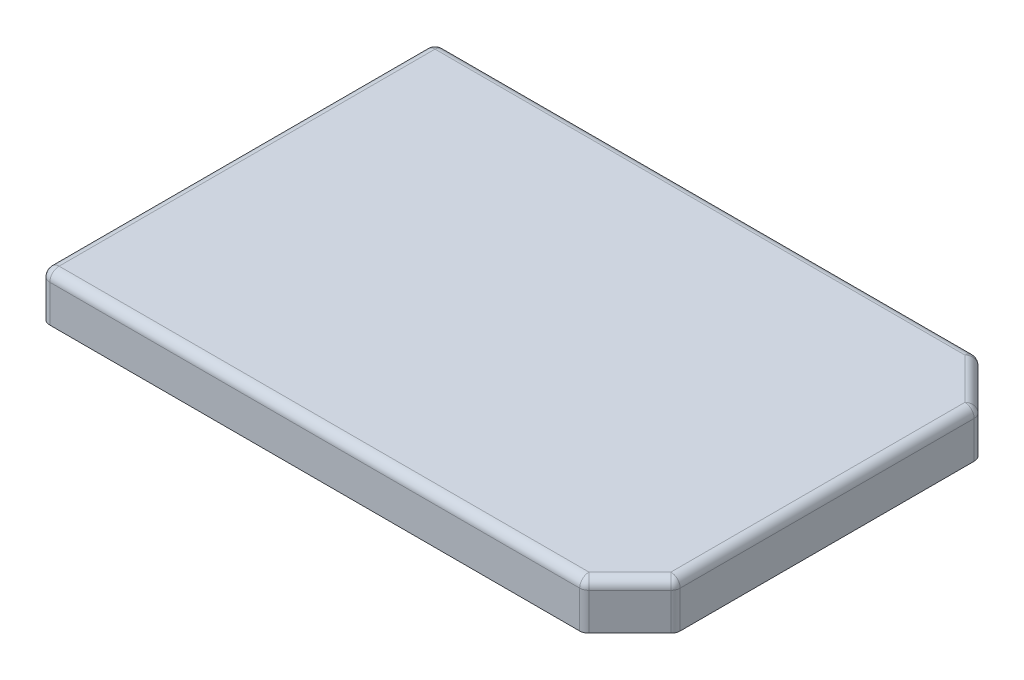
ISO-10303-21;
HEADER;
FILE_DESCRIPTION(('STEP AP214'),'2;1');
FILE_NAME('part.step','',(''),(''),'','','');
FILE_SCHEMA(('AUTOMOTIVE_DESIGN { 1 0 10303 214 1 1 1 1 }'));
ENDSEC;
DATA;
#1=APPLICATION_CONTEXT('core data for automotive mechanical design processes');
#2=APPLICATION_PROTOCOL_DEFINITION('international standard','automotive_design',2000,#1);
#3=PRODUCT_CONTEXT('',#1,'mechanical');
#4=PRODUCT('Part','Part','',(#3));
#5=PRODUCT_RELATED_PRODUCT_CATEGORY('part','',(#4));
#6=PRODUCT_DEFINITION_FORMATION('','',#4);
#7=PRODUCT_DEFINITION_CONTEXT('part definition',#1,'design');
#8=PRODUCT_DEFINITION('design','',#6,#7);
#9=PRODUCT_DEFINITION_SHAPE('','',#8);
#10=(LENGTH_UNIT() NAMED_UNIT(*) SI_UNIT(.MILLI.,.METRE.));
#11=(NAMED_UNIT(*) PLANE_ANGLE_UNIT() SI_UNIT($,.RADIAN.));
#12=(NAMED_UNIT(*) SI_UNIT($,.STERADIAN.) SOLID_ANGLE_UNIT());
#13=UNCERTAINTY_MEASURE_WITH_UNIT(LENGTH_MEASURE(1.E-05),#10,'distance_accuracy_value','');
#14=(GEOMETRIC_REPRESENTATION_CONTEXT(3) GLOBAL_UNCERTAINTY_ASSIGNED_CONTEXT((#13)) GLOBAL_UNIT_ASSIGNED_CONTEXT((#10,
#11,#12)) REPRESENTATION_CONTEXT('',''));
#15=CARTESIAN_POINT('',(0.,0.,0.));
#16=DIRECTION('',(0.,0.,1.));
#17=DIRECTION('',(1.,0.,0.));
#18=AXIS2_PLACEMENT_3D('',#15,#16,#17);
#19=CARTESIAN_POINT('',(0.,10.,0.));
#20=DIRECTION('',(1.,0.,0.));
#21=DIRECTION('',(0.,0.,-1.));
#22=AXIS2_PLACEMENT_3D('',#19,#20,#21);
#23=PLANE('',#22);
#24=DIRECTION('',(0.,-1.,0.));
#25=VECTOR('',#24,1.);
#26=CARTESIAN_POINT('',(0.,10.,83.));
#27=LINE('',#26,#25);
#28=CARTESIAN_POINT('',(0.,0.,83.));
#29=VERTEX_POINT('',#28);
#30=CARTESIAN_POINT('',(0.,8.,83.));
#31=VERTEX_POINT('',#30);
#32=EDGE_CURVE('E282',#29,#31,#27,.F.);
#33=ORIENTED_EDGE('',*,*,#32,.T.);
#34=DIRECTION('',(0.,0.,1.));
#35=VECTOR('',#34,1.);
#36=CARTESIAN_POINT('',(0.,8.,2.));
#37=LINE('',#36,#35);
#38=CARTESIAN_POINT('',(0.,8.,2.));
#39=VERTEX_POINT('',#38);
#40=EDGE_CURVE('E44',#31,#39,#37,.F.);
#41=ORIENTED_EDGE('',*,*,#40,.T.);
#42=DIRECTION('',(0.,-1.,0.));
#43=VECTOR('',#42,1.);
#44=CARTESIAN_POINT('',(0.,10.,2.));
#45=LINE('',#44,#43);
#46=CARTESIAN_POINT('',(0.,0.,2.));
#47=VERTEX_POINT('',#46);
#48=EDGE_CURVE('E280',#39,#47,#45,.T.);
#49=ORIENTED_EDGE('',*,*,#48,.T.);
#50=DIRECTION('',(0.,0.,1.));
#51=VECTOR('',#50,1.);
#52=CARTESIAN_POINT('',(0.,0.,0.));
#53=LINE('',#52,#51);
#54=EDGE_CURVE('E236',#47,#29,#53,.T.);
#55=ORIENTED_EDGE('',*,*,#54,.T.);
#56=EDGE_LOOP('',(#33,#41,#49,#55));
#57=FACE_BOUND('',#56,.T.);
#58=ADVANCED_FACE('F35',(#57),#23,.F.);
#59=CARTESIAN_POINT('',(0.,10.,85.));
#60=DIRECTION('',(0.,0.,-1.));
#61=DIRECTION('',(-1.,0.,0.));
#62=AXIS2_PLACEMENT_3D('',#59,#60,#61);
#63=PLANE('',#62);
#64=DIRECTION('',(0.,-1.,0.));
#65=VECTOR('',#64,1.);
#66=CARTESIAN_POINT('',(116.171572875254,10.,85.));
#67=LINE('',#66,#65);
#68=CARTESIAN_POINT('',(116.171572875254,0.,85.));
#69=VERTEX_POINT('',#68);
#70=CARTESIAN_POINT('',(116.171572875254,8.,85.));
#71=VERTEX_POINT('',#70);
#72=EDGE_CURVE('E277',#69,#71,#67,.F.);
#73=ORIENTED_EDGE('',*,*,#72,.T.);
#74=DIRECTION('',(1.,0.,0.));
#75=VECTOR('',#74,1.);
#76=CARTESIAN_POINT('',(2.00000000000001,8.,85.));
#77=LINE('',#76,#75);
#78=CARTESIAN_POINT('',(2.00000000000001,8.,85.));
#79=VERTEX_POINT('',#78);
#80=EDGE_CURVE('E326',#71,#79,#77,.F.);
#81=ORIENTED_EDGE('',*,*,#80,.T.);
#82=DIRECTION('',(0.,-1.,0.));
#83=VECTOR('',#82,1.);
#84=CARTESIAN_POINT('',(2.00000000000001,10.,85.));
#85=LINE('',#84,#83);
#86=CARTESIAN_POINT('',(2.00000000000001,0.,85.));
#87=VERTEX_POINT('',#86);
#88=EDGE_CURVE('E275',#79,#87,#85,.T.);
#89=ORIENTED_EDGE('',*,*,#88,.T.);
#90=DIRECTION('',(1.,0.,0.));
#91=VECTOR('',#90,1.);
#92=CARTESIAN_POINT('',(0.,0.,85.));
#93=LINE('',#92,#91);
#94=EDGE_CURVE('E239',#87,#69,#93,.T.);
#95=ORIENTED_EDGE('',*,*,#94,.T.);
#96=EDGE_LOOP('',(#73,#81,#89,#95));
#97=FACE_BOUND('',#96,.T.);
#98=ADVANCED_FACE('F462',(#97),#63,.F.);
#99=CARTESIAN_POINT('',(127.,10.,0.));
#100=DIRECTION('',(-1.,0.,0.));
#101=DIRECTION('',(0.,0.,1.));
#102=AXIS2_PLACEMENT_3D('',#99,#100,#101);
#103=PLANE('',#102);
#104=DIRECTION('',(0.,-1.,0.));
#105=VECTOR('',#104,1.);
#106=CARTESIAN_POINT('',(127.,10.,10.8284271247462));
#107=LINE('',#106,#105);
#108=CARTESIAN_POINT('',(127.,0.,10.8284271247462));
#109=VERTEX_POINT('',#108);
#110=CARTESIAN_POINT('',(127.,8.,10.8284271247462));
#111=VERTEX_POINT('',#110);
#112=EDGE_CURVE('E254',#109,#111,#107,.F.);
#113=ORIENTED_EDGE('',*,*,#112,.T.);
#114=DIRECTION('',(0.,0.,-1.));
#115=VECTOR('',#114,1.);
#116=CARTESIAN_POINT('',(127.,8.,74.1715728752538));
#117=LINE('',#116,#115);
#118=CARTESIAN_POINT('',(127.,8.,74.1715728752538));
#119=VERTEX_POINT('',#118);
#120=EDGE_CURVE('E11',#111,#119,#117,.F.);
#121=ORIENTED_EDGE('',*,*,#120,.T.);
#122=DIRECTION('',(0.,1.,0.));
#123=VECTOR('',#122,1.);
#124=CARTESIAN_POINT('',(127.,0.,74.1715728752538));
#125=LINE('',#124,#123);
#126=CARTESIAN_POINT('',(127.,0.,74.1715728752538));
#127=VERTEX_POINT('',#126);
#128=EDGE_CURVE('E256',#119,#127,#125,.F.);
#129=ORIENTED_EDGE('',*,*,#128,.T.);
#130=DIRECTION('',(0.,0.,-1.));
#131=VECTOR('',#130,1.);
#132=CARTESIAN_POINT('',(127.,0.,0.));
#133=LINE('',#132,#131);
#134=EDGE_CURVE('E242',#127,#109,#133,.T.);
#135=ORIENTED_EDGE('',*,*,#134,.T.);
#136=EDGE_LOOP('',(#113,#121,#129,#135));
#137=FACE_BOUND('',#136,.T.);
#138=ADVANCED_FACE('F422',(#137),#103,.F.);
#139=CARTESIAN_POINT('',(0.,10.,0.));
#140=DIRECTION('',(0.,0.,1.));
#141=DIRECTION('',(1.,0.,0.));
#142=AXIS2_PLACEMENT_3D('',#139,#140,#141);
#143=PLANE('',#142);
#144=DIRECTION('',(0.,-1.,0.));
#145=VECTOR('',#144,1.);
#146=CARTESIAN_POINT('',(2.,10.,0.));
#147=LINE('',#146,#145);
#148=CARTESIAN_POINT('',(2.,0.,0.));
#149=VERTEX_POINT('',#148);
#150=CARTESIAN_POINT('',(2.,8.,0.));
#151=VERTEX_POINT('',#150);
#152=EDGE_CURVE('E287',#149,#151,#147,.F.);
#153=ORIENTED_EDGE('',*,*,#152,.T.);
#154=DIRECTION('',(-1.,0.,0.));
#155=VECTOR('',#154,1.);
#156=CARTESIAN_POINT('',(116.171572875254,8.,0.));
#157=LINE('',#156,#155);
#158=CARTESIAN_POINT('',(116.171572875254,8.,0.));
#159=VERTEX_POINT('',#158);
#160=EDGE_CURVE('E319',#151,#159,#157,.F.);
#161=ORIENTED_EDGE('',*,*,#160,.T.);
#162=DIRECTION('',(0.,1.,0.));
#163=VECTOR('',#162,1.);
#164=CARTESIAN_POINT('',(116.171572875254,0.,0.));
#165=LINE('',#164,#163);
#166=CARTESIAN_POINT('',(116.171572875254,0.,0.));
#167=VERTEX_POINT('',#166);
#168=EDGE_CURVE('E285',#159,#167,#165,.F.);
#169=ORIENTED_EDGE('',*,*,#168,.T.);
#170=DIRECTION('',(-1.,0.,0.));
#171=VECTOR('',#170,1.);
#172=CARTESIAN_POINT('',(0.,0.,0.));
#173=LINE('',#172,#171);
#174=EDGE_CURVE('E245',#167,#149,#173,.T.);
#175=ORIENTED_EDGE('',*,*,#174,.T.);
#176=EDGE_LOOP('',(#153,#161,#169,#175));
#177=FACE_BOUND('',#176,.T.);
#178=ADVANCED_FACE('F376',(#177),#143,.F.);
#179=CARTESIAN_POINT('',(0.,10.,0.));
#180=DIRECTION('',(0.,1.,0.));
#181=DIRECTION('',(0.,0.,1.));
#182=AXIS2_PLACEMENT_3D('',#179,#180,#181);
#183=PLANE('',#182);
#184=DIRECTION('',(0.,0.,1.));
#185=VECTOR('',#184,1.);
#186=CARTESIAN_POINT('',(2.00000000000001,10.,83.));
#187=LINE('',#186,#185);
#188=CARTESIAN_POINT('',(2.,10.,2.));
#189=VERTEX_POINT('',#188);
#190=CARTESIAN_POINT('',(2.00000000000001,10.,83.));
#191=VERTEX_POINT('',#190);
#192=EDGE_CURVE('E307',#189,#191,#187,.T.);
#193=ORIENTED_EDGE('',*,*,#192,.T.);
#194=DIRECTION('',(1.,0.,0.));
#195=VECTOR('',#194,1.);
#196=CARTESIAN_POINT('',(116.171572875254,10.,83.));
#197=LINE('',#196,#195);
#198=CARTESIAN_POINT('',(116.171572875254,10.,83.));
#199=VERTEX_POINT('',#198);
#200=EDGE_CURVE('E309',#191,#199,#197,.T.);
#201=ORIENTED_EDGE('',*,*,#200,.T.);
#202=DIRECTION('',(-0.707106781186549,0.,0.707106781186546));
#203=VECTOR('',#202,1.);
#204=CARTESIAN_POINT('',(99.5857864376267,10.,99.5857864376271));
#205=LINE('',#204,#203);
#206=CARTESIAN_POINT('',(125.,10.,74.1715728752538));
#207=VERTEX_POINT('',#206);
#208=EDGE_CURVE('E304',#199,#207,#205,.F.);
#209=ORIENTED_EDGE('',*,*,#208,.T.);
#210=DIRECTION('',(0.,0.,-1.));
#211=VECTOR('',#210,1.);
#212=CARTESIAN_POINT('',(125.,10.,10.8284271247462));
#213=LINE('',#212,#211);
#214=CARTESIAN_POINT('',(125.,10.,10.8284271247462));
#215=VERTEX_POINT('',#214);
#216=EDGE_CURVE('E298',#207,#215,#213,.T.);
#217=ORIENTED_EDGE('',*,*,#216,.T.);
#218=DIRECTION('',(0.707106781186547,0.,0.707106781186549));
#219=VECTOR('',#218,1.);
#220=CARTESIAN_POINT('',(57.0857864376271,10.,-57.0857864376269));
#221=LINE('',#220,#219);
#222=CARTESIAN_POINT('',(116.171572875254,10.,2.));
#223=VERTEX_POINT('',#222);
#224=EDGE_CURVE('E300',#215,#223,#221,.F.);
#225=ORIENTED_EDGE('',*,*,#224,.T.);
#226=DIRECTION('',(-1.,0.,0.));
#227=VECTOR('',#226,1.);
#228=CARTESIAN_POINT('',(2.,10.,2.));
#229=LINE('',#228,#227);
#230=EDGE_CURVE('E302',#223,#189,#229,.T.);
#231=ORIENTED_EDGE('',*,*,#230,.T.);
#232=EDGE_LOOP('',(#193,#201,#209,#217,#225,#231));
#233=FACE_BOUND('',#232,.T.);
#234=ADVANCED_FACE('F403',(#233),#183,.T.);
#235=CARTESIAN_POINT('',(0.,0.,0.));
#236=DIRECTION('',(0.,1.,0.));
#237=DIRECTION('',(0.,0.,1.));
#238=AXIS2_PLACEMENT_3D('',#235,#236,#237);
#239=PLANE('',#238);
#240=DIRECTION('',(1.,0.,0.));
#241=VECTOR('',#240,1.);
#242=CARTESIAN_POINT('',(1.25000000000001,0.,1.25));
#243=LINE('',#242,#241);
#244=CARTESIAN_POINT('',(1.25000000000001,0.,1.25));
#245=VERTEX_POINT('',#244);
#246=CARTESIAN_POINT('',(115.75,0.,1.25));
#247=VERTEX_POINT('',#246);
#248=EDGE_CURVE('E216',#245,#247,#243,.T.);
#249=ORIENTED_EDGE('',*,*,#248,.F.);
#250=DIRECTION('',(0.,0.,-1.));
#251=VECTOR('',#250,1.);
#252=CARTESIAN_POINT('',(1.24999999999998,0.,83.75));
#253=LINE('',#252,#251);
#254=CARTESIAN_POINT('',(1.24999999999998,0.,83.75));
#255=VERTEX_POINT('',#254);
#256=EDGE_CURVE('E52',#255,#245,#253,.T.);
#257=ORIENTED_EDGE('',*,*,#256,.F.);
#258=DIRECTION('',(-1.,0.,0.));
#259=VECTOR('',#258,1.);
#260=CARTESIAN_POINT('',(1.24999999999998,0.,83.75));
#261=LINE('',#260,#259);
#262=CARTESIAN_POINT('',(115.75,0.,83.75));
#263=VERTEX_POINT('',#262);
#264=EDGE_CURVE('E202',#263,#255,#261,.T.);
#265=ORIENTED_EDGE('',*,*,#264,.F.);
#266=DIRECTION('',(-0.70710678118655,0.,0.707106781186545));
#267=VECTOR('',#266,1.);
#268=CARTESIAN_POINT('',(115.75,0.,83.75));
#269=LINE('',#268,#267);
#270=CARTESIAN_POINT('',(125.75,0.,73.7500000000001));
#271=VERTEX_POINT('',#270);
#272=EDGE_CURVE('E205',#271,#263,#269,.T.);
#273=ORIENTED_EDGE('',*,*,#272,.F.);
#274=DIRECTION('',(0.,0.,1.));
#275=VECTOR('',#274,1.);
#276=CARTESIAN_POINT('',(125.75,0.,73.7500000000001));
#277=LINE('',#276,#275);
#278=CARTESIAN_POINT('',(125.75,0.,11.25));
#279=VERTEX_POINT('',#278);
#280=EDGE_CURVE('E221',#279,#271,#277,.T.);
#281=ORIENTED_EDGE('',*,*,#280,.F.);
#282=DIRECTION('',(0.707106781186547,0.,0.707106781186548));
#283=VECTOR('',#282,1.);
#284=CARTESIAN_POINT('',(115.75,0.,1.25));
#285=LINE('',#284,#283);
#286=EDGE_CURVE('E218',#247,#279,#285,.T.);
#287=ORIENTED_EDGE('',*,*,#286,.F.);
#288=EDGE_LOOP('',(#249,#257,#265,#273,#281,#287));
#289=FACE_BOUND('',#288,.T.);
#290=ORIENTED_EDGE('',*,*,#134,.F.);
#291=CARTESIAN_POINT('',(125.,0.,74.1715728752538));
#292=DIRECTION('',(0.,1.,0.));
#293=DIRECTION('',(0.,0.,1.));
#294=AXIS2_PLACEMENT_3D('',#291,#292,#293);
#295=CIRCLE('',#294,2.);
#296=CARTESIAN_POINT('',(126.414213562373,0.,75.5857864376269));
#297=VERTEX_POINT('',#296);
#298=EDGE_CURVE('E268',#127,#297,#295,.F.);
#299=ORIENTED_EDGE('',*,*,#298,.T.);
#300=DIRECTION('',(0.707106781186549,0.,-0.707106781186546));
#301=VECTOR('',#300,1.);
#302=CARTESIAN_POINT('',(127.,0.,75.));
#303=LINE('',#302,#301);
#304=CARTESIAN_POINT('',(117.585786437627,0.,84.4142135623731));
#305=VERTEX_POINT('',#304);
#306=EDGE_CURVE('E251',#297,#305,#303,.F.);
#307=ORIENTED_EDGE('',*,*,#306,.T.);
#308=CARTESIAN_POINT('',(116.171572875254,0.,83.));
#309=DIRECTION('',(0.,1.,0.));
#310=DIRECTION('',(0.,0.,1.));
#311=AXIS2_PLACEMENT_3D('',#308,#309,#310);
#312=CIRCLE('',#311,2.);
#313=EDGE_CURVE('E266',#305,#69,#312,.F.);
#314=ORIENTED_EDGE('',*,*,#313,.T.);
#315=ORIENTED_EDGE('',*,*,#94,.F.);
#316=CARTESIAN_POINT('',(2.00000000000001,0.,83.));
#317=DIRECTION('',(0.,1.,0.));
#318=DIRECTION('',(0.,0.,1.));
#319=AXIS2_PLACEMENT_3D('',#316,#317,#318);
#320=CIRCLE('',#319,2.);
#321=EDGE_CURVE('E264',#87,#29,#320,.F.);
#322=ORIENTED_EDGE('',*,*,#321,.T.);
#323=ORIENTED_EDGE('',*,*,#54,.F.);
#324=CARTESIAN_POINT('',(2.,0.,2.));
#325=DIRECTION('',(0.,1.,0.));
#326=DIRECTION('',(0.,0.,1.));
#327=AXIS2_PLACEMENT_3D('',#324,#325,#326);
#328=CIRCLE('',#327,2.);
#329=EDGE_CURVE('E262',#47,#149,#328,.F.);
#330=ORIENTED_EDGE('',*,*,#329,.T.);
#331=ORIENTED_EDGE('',*,*,#174,.F.);
#332=CARTESIAN_POINT('',(116.171572875254,0.,2.));
#333=DIRECTION('',(0.,1.,0.));
#334=DIRECTION('',(0.,0.,1.));
#335=AXIS2_PLACEMENT_3D('',#332,#333,#334);
#336=CIRCLE('',#335,2.);
#337=CARTESIAN_POINT('',(117.585786437627,0.,0.5857864376269));
#338=VERTEX_POINT('',#337);
#339=EDGE_CURVE('E260',#167,#338,#336,.F.);
#340=ORIENTED_EDGE('',*,*,#339,.T.);
#341=DIRECTION('',(-0.707106781186547,0.,-0.707106781186549));
#342=VECTOR('',#341,1.);
#343=CARTESIAN_POINT('',(117.,0.,0.));
#344=LINE('',#343,#342);
#345=CARTESIAN_POINT('',(126.414213562373,0.,9.41421356237312));
#346=VERTEX_POINT('',#345);
#347=EDGE_CURVE('E248',#338,#346,#344,.F.);
#348=ORIENTED_EDGE('',*,*,#347,.T.);
#349=CARTESIAN_POINT('',(125.,0.,10.8284271247462));
#350=DIRECTION('',(0.,1.,0.));
#351=DIRECTION('',(0.,0.,1.));
#352=AXIS2_PLACEMENT_3D('',#349,#350,#351);
#353=CIRCLE('',#352,2.);
#354=EDGE_CURVE('E258',#346,#109,#353,.F.);
#355=ORIENTED_EDGE('',*,*,#354,.T.);
#356=EDGE_LOOP('',(#290,#299,#307,#314,#315,#322,#323,#330,#331,#340,#348,#355));
#357=FACE_BOUND('',#356,.T.);
#358=ADVANCED_FACE('F382',(#289,#357),#239,.F.);
#359=CARTESIAN_POINT('',(127.,10.,75.));
#360=DIRECTION('',(-0.707106781186546,0.,-0.707106781186549));
#361=DIRECTION('',(0.,-1.,0.));
#362=AXIS2_PLACEMENT_3D('',#359,#360,#361);
#363=PLANE('',#362);
#364=DIRECTION('',(0.,-1.,0.));
#365=VECTOR('',#364,1.);
#366=CARTESIAN_POINT('',(126.414213562373,10.,75.5857864376269));
#367=LINE('',#366,#365);
#368=CARTESIAN_POINT('',(126.414213562373,8.,75.5857864376269));
#369=VERTEX_POINT('',#368);
#370=EDGE_CURVE('E272',#297,#369,#367,.F.);
#371=ORIENTED_EDGE('',*,*,#370,.T.);
#372=DIRECTION('',(0.707106781186549,0.,-0.707106781186546));
#373=VECTOR('',#372,1.);
#374=CARTESIAN_POINT('',(127.,8.,75.));
#375=LINE('',#374,#373);
#376=CARTESIAN_POINT('',(117.585786437627,8.,84.4142135623731));
#377=VERTEX_POINT('',#376);
#378=EDGE_CURVE('E311',#369,#377,#375,.F.);
#379=ORIENTED_EDGE('',*,*,#378,.T.);
#380=DIRECTION('',(0.,1.,0.));
#381=VECTOR('',#380,1.);
#382=CARTESIAN_POINT('',(117.585786437627,0.,84.4142135623731));
#383=LINE('',#382,#381);
#384=EDGE_CURVE('E270',#377,#305,#383,.F.);
#385=ORIENTED_EDGE('',*,*,#384,.T.);
#386=ORIENTED_EDGE('',*,*,#306,.F.);
#387=EDGE_LOOP('',(#371,#379,#385,#386));
#388=FACE_BOUND('',#387,.T.);
#389=ADVANCED_FACE('F434',(#388),#363,.F.);
#390=CARTESIAN_POINT('',(117.,10.,0.));
#391=DIRECTION('',(-0.707106781186548,0.,0.707106781186546));
#392=DIRECTION('',(0.,-1.,0.));
#393=AXIS2_PLACEMENT_3D('',#390,#391,#392);
#394=PLANE('',#393);
#395=DIRECTION('',(0.,-1.,0.));
#396=VECTOR('',#395,1.);
#397=CARTESIAN_POINT('',(117.585786437627,10.,0.5857864376269));
#398=LINE('',#397,#396);
#399=CARTESIAN_POINT('',(117.585786437627,8.,0.5857864376269));
#400=VERTEX_POINT('',#399);
#401=EDGE_CURVE('E292',#338,#400,#398,.F.);
#402=ORIENTED_EDGE('',*,*,#401,.T.);
#403=DIRECTION('',(-0.707106781186547,0.,-0.707106781186549));
#404=VECTOR('',#403,1.);
#405=CARTESIAN_POINT('',(117.,8.,0.));
#406=LINE('',#405,#404);
#407=CARTESIAN_POINT('',(126.414213562373,8.,9.41421356237312));
#408=VERTEX_POINT('',#407);
#409=EDGE_CURVE('E323',#400,#408,#406,.F.);
#410=ORIENTED_EDGE('',*,*,#409,.T.);
#411=DIRECTION('',(0.,1.,0.));
#412=VECTOR('',#411,1.);
#413=CARTESIAN_POINT('',(126.414213562373,0.,9.41421356237312));
#414=LINE('',#413,#412);
#415=EDGE_CURVE('E290',#408,#346,#414,.F.);
#416=ORIENTED_EDGE('',*,*,#415,.T.);
#417=ORIENTED_EDGE('',*,*,#347,.F.);
#418=EDGE_LOOP('',(#402,#410,#416,#417));
#419=FACE_BOUND('',#418,.T.);
#420=ADVANCED_FACE('F417',(#419),#394,.F.);
#421=CARTESIAN_POINT('',(125.,10.,74.1715728752538));
#422=DIRECTION('',(0.,-1.,0.));
#423=DIRECTION('',(0.,0.,-1.));
#424=AXIS2_PLACEMENT_3D('',#421,#422,#423);
#425=CYLINDRICAL_SURFACE('',#424,2.);
#426=ORIENTED_EDGE('',*,*,#128,.F.);
#427=CARTESIAN_POINT('',(125.,8.,74.1715728752538));
#428=DIRECTION('',(0.,-1.,0.));
#429=DIRECTION('',(0.,0.,-1.));
#430=AXIS2_PLACEMENT_3D('',#427,#428,#429);
#431=CIRCLE('',#430,2.);
#432=EDGE_CURVE('E295',#119,#369,#431,.T.);
#433=ORIENTED_EDGE('',*,*,#432,.T.);
#434=ORIENTED_EDGE('',*,*,#370,.F.);
#435=ORIENTED_EDGE('',*,*,#298,.F.);
#436=EDGE_LOOP('',(#426,#433,#434,#435));
#437=FACE_BOUND('',#436,.T.);
#438=ADVANCED_FACE('F430',(#437),#425,.T.);
#439=CARTESIAN_POINT('',(116.171572875254,10.,83.));
#440=DIRECTION('',(0.,1.,0.));
#441=DIRECTION('',(0.,0.,1.));
#442=AXIS2_PLACEMENT_3D('',#439,#440,#441);
#443=CYLINDRICAL_SURFACE('',#442,2.);
#444=ORIENTED_EDGE('',*,*,#384,.F.);
#445=CARTESIAN_POINT('',(116.171572875254,8.,83.));
#446=DIRECTION('',(0.,1.,0.));
#447=DIRECTION('',(0.,0.,1.));
#448=AXIS2_PLACEMENT_3D('',#445,#446,#447);
#449=CIRCLE('',#448,2.);
#450=EDGE_CURVE('E313',#377,#71,#449,.F.);
#451=ORIENTED_EDGE('',*,*,#450,.T.);
#452=ORIENTED_EDGE('',*,*,#72,.F.);
#453=ORIENTED_EDGE('',*,*,#313,.F.);
#454=EDGE_LOOP('',(#444,#451,#452,#453));
#455=FACE_BOUND('',#454,.T.);
#456=ADVANCED_FACE('F439',(#455),#443,.T.);
#457=CARTESIAN_POINT('',(2.00000000000001,10.,83.));
#458=DIRECTION('',(0.,-1.,0.));
#459=DIRECTION('',(0.,0.,-1.));
#460=AXIS2_PLACEMENT_3D('',#457,#458,#459);
#461=CYLINDRICAL_SURFACE('',#460,2.);
#462=ORIENTED_EDGE('',*,*,#88,.F.);
#463=CARTESIAN_POINT('',(2.00000000000001,8.,83.));
#464=DIRECTION('',(0.,-1.,0.));
#465=DIRECTION('',(0.,0.,-1.));
#466=AXIS2_PLACEMENT_3D('',#463,#464,#465);
#467=CIRCLE('',#466,2.);
#468=EDGE_CURVE('E315',#79,#31,#467,.T.);
#469=ORIENTED_EDGE('',*,*,#468,.T.);
#470=ORIENTED_EDGE('',*,*,#32,.F.);
#471=ORIENTED_EDGE('',*,*,#321,.F.);
#472=EDGE_LOOP('',(#462,#469,#470,#471));
#473=FACE_BOUND('',#472,.T.);
#474=ADVANCED_FACE('F391',(#473),#461,.T.);
#475=CARTESIAN_POINT('',(2.,10.,2.));
#476=DIRECTION('',(0.,-1.,0.));
#477=DIRECTION('',(0.,0.,-1.));
#478=AXIS2_PLACEMENT_3D('',#475,#476,#477);
#479=CYLINDRICAL_SURFACE('',#478,2.);
#480=ORIENTED_EDGE('',*,*,#48,.F.);
#481=CARTESIAN_POINT('',(2.,8.,2.));
#482=DIRECTION('',(0.,-1.,0.));
#483=DIRECTION('',(0.,0.,-1.));
#484=AXIS2_PLACEMENT_3D('',#481,#482,#483);
#485=CIRCLE('',#484,2.);
#486=EDGE_CURVE('E317',#39,#151,#485,.T.);
#487=ORIENTED_EDGE('',*,*,#486,.T.);
#488=ORIENTED_EDGE('',*,*,#152,.F.);
#489=ORIENTED_EDGE('',*,*,#329,.F.);
#490=EDGE_LOOP('',(#480,#487,#488,#489));
#491=FACE_BOUND('',#490,.T.);
#492=ADVANCED_FACE('F373',(#491),#479,.T.);
#493=CARTESIAN_POINT('',(116.171572875254,10.,2.));
#494=DIRECTION('',(0.,-1.,0.));
#495=DIRECTION('',(0.,0.,-1.));
#496=AXIS2_PLACEMENT_3D('',#493,#494,#495);
#497=CYLINDRICAL_SURFACE('',#496,2.);
#498=ORIENTED_EDGE('',*,*,#168,.F.);
#499=CARTESIAN_POINT('',(116.171572875254,8.,2.));
#500=DIRECTION('',(0.,-1.,0.));
#501=DIRECTION('',(0.,0.,-1.));
#502=AXIS2_PLACEMENT_3D('',#499,#500,#501);
#503=CIRCLE('',#502,2.);
#504=EDGE_CURVE('E321',#159,#400,#503,.T.);
#505=ORIENTED_EDGE('',*,*,#504,.T.);
#506=ORIENTED_EDGE('',*,*,#401,.F.);
#507=ORIENTED_EDGE('',*,*,#339,.F.);
#508=EDGE_LOOP('',(#498,#505,#506,#507));
#509=FACE_BOUND('',#508,.T.);
#510=ADVANCED_FACE('F483',(#509),#497,.T.);
#511=CARTESIAN_POINT('',(125.,10.,10.8284271247462));
#512=DIRECTION('',(0.,1.,0.));
#513=DIRECTION('',(0.,0.,1.));
#514=AXIS2_PLACEMENT_3D('',#511,#512,#513);
#515=CYLINDRICAL_SURFACE('',#514,2.);
#516=ORIENTED_EDGE('',*,*,#415,.F.);
#517=CARTESIAN_POINT('',(125.,8.,10.8284271247462));
#518=DIRECTION('',(0.,1.,0.));
#519=DIRECTION('',(0.,0.,1.));
#520=AXIS2_PLACEMENT_3D('',#517,#518,#519);
#521=CIRCLE('',#520,2.);
#522=EDGE_CURVE('E60',#408,#111,#521,.F.);
#523=ORIENTED_EDGE('',*,*,#522,.T.);
#524=ORIENTED_EDGE('',*,*,#112,.F.);
#525=ORIENTED_EDGE('',*,*,#354,.F.);
#526=EDGE_LOOP('',(#516,#523,#524,#525));
#527=FACE_BOUND('',#526,.T.);
#528=ADVANCED_FACE('F420',(#527),#515,.T.);
#529=CARTESIAN_POINT('',(2.,8.,2.));
#530=DIRECTION('',(0.,1.,0.));
#531=DIRECTION('',(0.,0.,1.));
#532=AXIS2_PLACEMENT_3D('',#529,#530,#531);
#533=SPHERICAL_SURFACE('',#532,2.);
#534=CARTESIAN_POINT('',(2.,8.,2.));
#535=DIRECTION('',(1.,0.,0.));
#536=DIRECTION('',(0.,0.,-1.));
#537=AXIS2_PLACEMENT_3D('',#534,#535,#536);
#538=CIRCLE('',#537,2.);
#539=EDGE_CURVE('E355',#151,#189,#538,.T.);
#540=ORIENTED_EDGE('',*,*,#539,.F.);
#541=ORIENTED_EDGE('',*,*,#486,.F.);
#542=CARTESIAN_POINT('',(2.,8.,2.));
#543=DIRECTION('',(0.,0.,1.));
#544=DIRECTION('',(1.,0.,0.));
#545=AXIS2_PLACEMENT_3D('',#542,#543,#544);
#546=CIRCLE('',#545,2.);
#547=EDGE_CURVE('E39',#189,#39,#546,.T.);
#548=ORIENTED_EDGE('',*,*,#547,.F.);
#549=EDGE_LOOP('',(#540,#541,#548));
#550=FACE_BOUND('',#549,.T.);
#551=ADVANCED_FACE('F37',(#550),#533,.T.);
#552=CARTESIAN_POINT('',(2.,8.,0.));
#553=DIRECTION('',(0.,0.,-1.));
#554=DIRECTION('',(-1.,0.,0.));
#555=AXIS2_PLACEMENT_3D('',#552,#553,#554);
#556=CYLINDRICAL_SURFACE('',#555,2.);
#557=ORIENTED_EDGE('',*,*,#547,.T.);
#558=ORIENTED_EDGE('',*,*,#40,.F.);
#559=CARTESIAN_POINT('',(2.00000000000001,8.,83.));
#560=DIRECTION('',(0.,0.,1.));
#561=DIRECTION('',(1.,0.,0.));
#562=AXIS2_PLACEMENT_3D('',#559,#560,#561);
#563=CIRCLE('',#562,2.);
#564=EDGE_CURVE('E353',#191,#31,#563,.T.);
#565=ORIENTED_EDGE('',*,*,#564,.F.);
#566=ORIENTED_EDGE('',*,*,#192,.F.);
#567=EDGE_LOOP('',(#557,#558,#565,#566));
#568=FACE_BOUND('',#567,.T.);
#569=ADVANCED_FACE('F366',(#568),#556,.T.);
#570=CARTESIAN_POINT('',(0.,8.,2.));
#571=DIRECTION('',(1.,0.,0.));
#572=DIRECTION('',(0.,0.,-1.));
#573=AXIS2_PLACEMENT_3D('',#570,#571,#572);
#574=CYLINDRICAL_SURFACE('',#573,2.);
#575=ORIENTED_EDGE('',*,*,#539,.T.);
#576=ORIENTED_EDGE('',*,*,#230,.F.);
#577=CARTESIAN_POINT('',(116.171572875254,8.,2.));
#578=DIRECTION('',(1.,0.,0.));
#579=DIRECTION('',(0.,0.,-1.));
#580=AXIS2_PLACEMENT_3D('',#577,#578,#579);
#581=CIRCLE('',#580,2.);
#582=EDGE_CURVE('E350',#159,#223,#581,.T.);
#583=ORIENTED_EDGE('',*,*,#582,.F.);
#584=ORIENTED_EDGE('',*,*,#160,.F.);
#585=EDGE_LOOP('',(#575,#576,#583,#584));
#586=FACE_BOUND('',#585,.T.);
#587=ADVANCED_FACE('F407',(#586),#574,.T.);
#588=CARTESIAN_POINT('',(2.00000000000001,8.,83.));
#589=DIRECTION('',(0.,1.,0.));
#590=DIRECTION('',(0.,0.,1.));
#591=AXIS2_PLACEMENT_3D('',#588,#589,#590);
#592=SPHERICAL_SURFACE('',#591,2.);
#593=ORIENTED_EDGE('',*,*,#564,.T.);
#594=ORIENTED_EDGE('',*,*,#468,.F.);
#595=CARTESIAN_POINT('',(2.00000000000001,8.,83.));
#596=DIRECTION('',(1.,0.,0.));
#597=DIRECTION('',(0.,0.,-1.));
#598=AXIS2_PLACEMENT_3D('',#595,#596,#597);
#599=CIRCLE('',#598,2.);
#600=EDGE_CURVE('E347',#191,#79,#599,.T.);
#601=ORIENTED_EDGE('',*,*,#600,.F.);
#602=EDGE_LOOP('',(#593,#594,#601));
#603=FACE_BOUND('',#602,.T.);
#604=ADVANCED_FACE('F395',(#603),#592,.T.);
#605=CARTESIAN_POINT('',(116.171572875254,8.,2.));
#606=DIRECTION('',(0.,1.,0.));
#607=DIRECTION('',(0.,0.,1.));
#608=AXIS2_PLACEMENT_3D('',#605,#606,#607);
#609=SPHERICAL_SURFACE('',#608,2.);
#610=ORIENTED_EDGE('',*,*,#504,.F.);
#611=ORIENTED_EDGE('',*,*,#582,.T.);
#612=CARTESIAN_POINT('',(116.171572875254,8.,2.));
#613=DIRECTION('',(0.707106781186549,0.,0.707106781186546));
#614=DIRECTION('',(0.707106781186546,0.,-0.707106781186549));
#615=AXIS2_PLACEMENT_3D('',#612,#613,#614);
#616=CIRCLE('',#615,2.);
#617=EDGE_CURVE('E344',#400,#223,#616,.T.);
#618=ORIENTED_EDGE('',*,*,#617,.F.);
#619=EDGE_LOOP('',(#610,#611,#618));
#620=FACE_BOUND('',#619,.T.);
#621=ADVANCED_FACE('F411',(#620),#609,.T.);
#622=CARTESIAN_POINT('',(0.,8.,83.));
#623=DIRECTION('',(-1.,0.,0.));
#624=DIRECTION('',(0.,0.,1.));
#625=AXIS2_PLACEMENT_3D('',#622,#623,#624);
#626=CYLINDRICAL_SURFACE('',#625,2.);
#627=ORIENTED_EDGE('',*,*,#600,.T.);
#628=ORIENTED_EDGE('',*,*,#80,.F.);
#629=CARTESIAN_POINT('',(116.171572875254,8.,83.));
#630=DIRECTION('',(1.,0.,0.));
#631=DIRECTION('',(0.,0.,-1.));
#632=AXIS2_PLACEMENT_3D('',#629,#630,#631);
#633=CIRCLE('',#632,2.);
#634=EDGE_CURVE('E341',#199,#71,#633,.T.);
#635=ORIENTED_EDGE('',*,*,#634,.F.);
#636=ORIENTED_EDGE('',*,*,#200,.F.);
#637=EDGE_LOOP('',(#627,#628,#635,#636));
#638=FACE_BOUND('',#637,.T.);
#639=ADVANCED_FACE('F399',(#638),#626,.T.);
#640=CARTESIAN_POINT('',(57.0857864376271,8.,-57.0857864376269));
#641=DIRECTION('',(0.707106781186547,0.,0.707106781186549));
#642=DIRECTION('',(0.707106781186549,0.,-0.707106781186547));
#643=AXIS2_PLACEMENT_3D('',#640,#641,#642);
#644=CYLINDRICAL_SURFACE('',#643,2.);
#645=ORIENTED_EDGE('',*,*,#617,.T.);
#646=ORIENTED_EDGE('',*,*,#224,.F.);
#647=CARTESIAN_POINT('',(125.,8.,10.8284271247462));
#648=DIRECTION('',(0.707106781186545,0.,0.70710678118655));
#649=DIRECTION('',(0.70710678118655,0.,-0.707106781186545));
#650=AXIS2_PLACEMENT_3D('',#647,#648,#649);
#651=CIRCLE('',#650,2.);
#652=EDGE_CURVE('E338',#408,#215,#651,.T.);
#653=ORIENTED_EDGE('',*,*,#652,.F.);
#654=ORIENTED_EDGE('',*,*,#409,.F.);
#655=EDGE_LOOP('',(#645,#646,#653,#654));
#656=FACE_BOUND('',#655,.T.);
#657=ADVANCED_FACE('F414',(#656),#644,.T.);
#658=CARTESIAN_POINT('',(116.171572875254,8.,83.));
#659=DIRECTION('',(0.,1.,0.));
#660=DIRECTION('',(0.,0.,1.));
#661=AXIS2_PLACEMENT_3D('',#658,#659,#660);
#662=SPHERICAL_SURFACE('',#661,2.);
#663=ORIENTED_EDGE('',*,*,#634,.T.);
#664=ORIENTED_EDGE('',*,*,#450,.F.);
#665=CARTESIAN_POINT('',(116.171572875254,8.,83.));
#666=DIRECTION('',(0.707106781186551,0.,-0.707106781186544));
#667=DIRECTION('',(-0.707106781186544,0.,-0.707106781186551));
#668=AXIS2_PLACEMENT_3D('',#665,#666,#667);
#669=CIRCLE('',#668,2.);
#670=EDGE_CURVE('E335',#199,#377,#669,.T.);
#671=ORIENTED_EDGE('',*,*,#670,.F.);
#672=EDGE_LOOP('',(#663,#664,#671));
#673=FACE_BOUND('',#672,.T.);
#674=ADVANCED_FACE('F442',(#673),#662,.T.);
#675=CARTESIAN_POINT('',(125.,8.,10.8284271247462));
#676=DIRECTION('',(0.,1.,0.));
#677=DIRECTION('',(0.,0.,1.));
#678=AXIS2_PLACEMENT_3D('',#675,#676,#677);
#679=SPHERICAL_SURFACE('',#678,2.);
#680=ORIENTED_EDGE('',*,*,#522,.F.);
#681=ORIENTED_EDGE('',*,*,#652,.T.);
#682=CARTESIAN_POINT('',(125.,8.,10.8284271247462));
#683=DIRECTION('',(0.,0.,1.));
#684=DIRECTION('',(1.,0.,0.));
#685=AXIS2_PLACEMENT_3D('',#682,#683,#684);
#686=CIRCLE('',#685,2.);
#687=EDGE_CURVE('E332',#111,#215,#686,.T.);
#688=ORIENTED_EDGE('',*,*,#687,.F.);
#689=EDGE_LOOP('',(#680,#681,#688));
#690=FACE_BOUND('',#689,.T.);
#691=ADVANCED_FACE('F452',(#690),#679,.T.);
#692=CARTESIAN_POINT('',(99.5857864376267,8.,99.5857864376271));
#693=DIRECTION('',(-0.707106781186549,0.,0.707106781186546));
#694=DIRECTION('',(0.707106781186546,0.,0.707106781186549));
#695=AXIS2_PLACEMENT_3D('',#692,#693,#694);
#696=CYLINDRICAL_SURFACE('',#695,2.);
#697=ORIENTED_EDGE('',*,*,#670,.T.);
#698=ORIENTED_EDGE('',*,*,#378,.F.);
#699=CARTESIAN_POINT('',(125.,8.,74.1715728752538));
#700=DIRECTION('',(0.707106781186548,0.,-0.707106781186548));
#701=DIRECTION('',(-0.707106781186548,0.,-0.707106781186548));
#702=AXIS2_PLACEMENT_3D('',#699,#700,#701);
#703=CIRCLE('',#702,2.);
#704=EDGE_CURVE('E330',#207,#369,#703,.T.);
#705=ORIENTED_EDGE('',*,*,#704,.F.);
#706=ORIENTED_EDGE('',*,*,#208,.F.);
#707=EDGE_LOOP('',(#697,#698,#705,#706));
#708=FACE_BOUND('',#707,.T.);
#709=ADVANCED_FACE('F444',(#708),#696,.T.);
#710=CARTESIAN_POINT('',(125.,8.,0.));
#711=DIRECTION('',(0.,0.,1.));
#712=DIRECTION('',(1.,0.,0.));
#713=AXIS2_PLACEMENT_3D('',#710,#711,#712);
#714=CYLINDRICAL_SURFACE('',#713,2.);
#715=ORIENTED_EDGE('',*,*,#687,.T.);
#716=ORIENTED_EDGE('',*,*,#216,.F.);
#717=CARTESIAN_POINT('',(125.,8.,74.1715728752538));
#718=DIRECTION('',(0.,0.,1.));
#719=DIRECTION('',(1.,0.,0.));
#720=AXIS2_PLACEMENT_3D('',#717,#718,#719);
#721=CIRCLE('',#720,2.);
#722=EDGE_CURVE('E228',#119,#207,#721,.T.);
#723=ORIENTED_EDGE('',*,*,#722,.F.);
#724=ORIENTED_EDGE('',*,*,#120,.F.);
#725=EDGE_LOOP('',(#715,#716,#723,#724));
#726=FACE_BOUND('',#725,.T.);
#727=ADVANCED_FACE('F450',(#726),#714,.T.);
#728=CARTESIAN_POINT('',(125.,8.,74.1715728752538));
#729=DIRECTION('',(0.,1.,0.));
#730=DIRECTION('',(0.,0.,1.));
#731=AXIS2_PLACEMENT_3D('',#728,#729,#730);
#732=SPHERICAL_SURFACE('',#731,2.);
#733=ORIENTED_EDGE('',*,*,#704,.T.);
#734=ORIENTED_EDGE('',*,*,#432,.F.);
#735=ORIENTED_EDGE('',*,*,#722,.T.);
#736=EDGE_LOOP('',(#733,#734,#735));
#737=FACE_BOUND('',#736,.T.);
#738=ADVANCED_FACE('F489',(#737),#732,.T.);
#739=CARTESIAN_POINT('',(1.24999999999998,7.3,83.75));
#740=DIRECTION('',(-1.,0.,0.));
#741=DIRECTION('',(0.,0.,1.));
#742=AXIS2_PLACEMENT_3D('',#739,#740,#741);
#743=PLANE('',#742);
#744=ORIENTED_EDGE('',*,*,#256,.T.);
#745=DIRECTION('',(0.,-1.,0.));
#746=VECTOR('',#745,1.);
#747=CARTESIAN_POINT('',(1.25000000000001,7.3,1.25));
#748=LINE('',#747,#746);
#749=CARTESIAN_POINT('',(1.25000000000001,7.3,1.25));
#750=VERTEX_POINT('',#749);
#751=EDGE_CURVE('E179',#750,#245,#748,.T.);
#752=ORIENTED_EDGE('',*,*,#751,.F.);
#753=DIRECTION('',(0.,0.,-1.));
#754=VECTOR('',#753,1.);
#755=CARTESIAN_POINT('',(1.24999999999998,7.3,83.75));
#756=LINE('',#755,#754);
#757=CARTESIAN_POINT('',(1.24999999999998,7.3,83.75));
#758=VERTEX_POINT('',#757);
#759=EDGE_CURVE('E183',#758,#750,#756,.T.);
#760=ORIENTED_EDGE('',*,*,#759,.F.);
#761=DIRECTION('',(0.,-1.,0.));
#762=VECTOR('',#761,1.);
#763=CARTESIAN_POINT('',(1.24999999999998,7.3,83.75));
#764=LINE('',#763,#762);
#765=EDGE_CURVE('E226',#758,#255,#764,.T.);
#766=ORIENTED_EDGE('',*,*,#765,.T.);
#767=EDGE_LOOP('',(#744,#752,#760,#766));
#768=FACE_BOUND('',#767,.T.);
#769=ADVANCED_FACE('F181',(#768),#743,.F.);
#770=CARTESIAN_POINT('',(1.24999999999998,7.3,83.75));
#771=DIRECTION('',(0.,0.,1.));
#772=DIRECTION('',(1.,0.,0.));
#773=AXIS2_PLACEMENT_3D('',#770,#771,#772);
#774=PLANE('',#773);
#775=ORIENTED_EDGE('',*,*,#264,.T.);
#776=ORIENTED_EDGE('',*,*,#765,.F.);
#777=DIRECTION('',(-1.,0.,0.));
#778=VECTOR('',#777,1.);
#779=CARTESIAN_POINT('',(1.24999999999998,7.3,83.75));
#780=LINE('',#779,#778);
#781=CARTESIAN_POINT('',(115.75,7.3,83.75));
#782=VERTEX_POINT('',#781);
#783=EDGE_CURVE('E189',#782,#758,#780,.T.);
#784=ORIENTED_EDGE('',*,*,#783,.F.);
#785=DIRECTION('',(0.,-1.,0.));
#786=VECTOR('',#785,1.);
#787=CARTESIAN_POINT('',(115.75,7.3,83.75));
#788=LINE('',#787,#786);
#789=EDGE_CURVE('E229',#782,#263,#788,.T.);
#790=ORIENTED_EDGE('',*,*,#789,.T.);
#791=EDGE_LOOP('',(#775,#776,#784,#790));
#792=FACE_BOUND('',#791,.T.);
#793=ADVANCED_FACE('F508',(#792),#774,.F.);
#794=CARTESIAN_POINT('',(115.75,7.3,83.75));
#795=DIRECTION('',(0.707106781186545,0.,0.70710678118655));
#796=DIRECTION('',(0.70710678118655,0.,-0.707106781186545));
#797=AXIS2_PLACEMENT_3D('',#794,#795,#796);
#798=PLANE('',#797);
#799=ORIENTED_EDGE('',*,*,#272,.T.);
#800=ORIENTED_EDGE('',*,*,#789,.F.);
#801=DIRECTION('',(-0.70710678118655,0.,0.707106781186545));
#802=VECTOR('',#801,1.);
#803=CARTESIAN_POINT('',(115.75,7.3,83.75));
#804=LINE('',#803,#802);
#805=CARTESIAN_POINT('',(125.75,7.3,73.7500000000001));
#806=VERTEX_POINT('',#805);
#807=EDGE_CURVE('E212',#806,#782,#804,.T.);
#808=ORIENTED_EDGE('',*,*,#807,.F.);
#809=DIRECTION('',(0.,-1.,0.));
#810=VECTOR('',#809,1.);
#811=CARTESIAN_POINT('',(125.75,7.3,73.7500000000001));
#812=LINE('',#811,#810);
#813=EDGE_CURVE('E231',#806,#271,#812,.T.);
#814=ORIENTED_EDGE('',*,*,#813,.T.);
#815=EDGE_LOOP('',(#799,#800,#808,#814));
#816=FACE_BOUND('',#815,.T.);
#817=ADVANCED_FACE('F515',(#816),#798,.F.);
#818=CARTESIAN_POINT('',(125.75,7.3,73.7500000000001));
#819=DIRECTION('',(1.,0.,0.));
#820=DIRECTION('',(0.,0.,-1.));
#821=AXIS2_PLACEMENT_3D('',#818,#819,#820);
#822=PLANE('',#821);
#823=ORIENTED_EDGE('',*,*,#280,.T.);
#824=ORIENTED_EDGE('',*,*,#813,.F.);
#825=DIRECTION('',(0.,0.,1.));
#826=VECTOR('',#825,1.);
#827=CARTESIAN_POINT('',(125.75,7.3,73.7500000000001));
#828=LINE('',#827,#826);
#829=CARTESIAN_POINT('',(125.75,7.3,11.25));
#830=VERTEX_POINT('',#829);
#831=EDGE_CURVE('E209',#830,#806,#828,.T.);
#832=ORIENTED_EDGE('',*,*,#831,.F.);
#833=DIRECTION('',(0.,-1.,0.));
#834=VECTOR('',#833,1.);
#835=CARTESIAN_POINT('',(125.75,7.3,11.25));
#836=LINE('',#835,#834);
#837=EDGE_CURVE('E233',#830,#279,#836,.T.);
#838=ORIENTED_EDGE('',*,*,#837,.T.);
#839=EDGE_LOOP('',(#823,#824,#832,#838));
#840=FACE_BOUND('',#839,.T.);
#841=ADVANCED_FACE('F523',(#840),#822,.F.);
#842=CARTESIAN_POINT('',(115.75,7.3,1.25));
#843=DIRECTION('',(0.707106781186548,0.,-0.707106781186547));
#844=DIRECTION('',(-0.707106781186547,0.,-0.707106781186548));
#845=AXIS2_PLACEMENT_3D('',#842,#843,#844);
#846=PLANE('',#845);
#847=ORIENTED_EDGE('',*,*,#286,.T.);
#848=ORIENTED_EDGE('',*,*,#837,.F.);
#849=DIRECTION('',(0.707106781186547,0.,0.707106781186548));
#850=VECTOR('',#849,1.);
#851=CARTESIAN_POINT('',(115.75,7.3,1.25));
#852=LINE('',#851,#850);
#853=CARTESIAN_POINT('',(115.75,7.3,1.25));
#854=VERTEX_POINT('',#853);
#855=EDGE_CURVE('E197',#854,#830,#852,.T.);
#856=ORIENTED_EDGE('',*,*,#855,.F.);
#857=DIRECTION('',(0.,-1.,0.));
#858=VECTOR('',#857,1.);
#859=CARTESIAN_POINT('',(115.75,7.3,1.25));
#860=LINE('',#859,#858);
#861=EDGE_CURVE('E188',#854,#247,#860,.T.);
#862=ORIENTED_EDGE('',*,*,#861,.T.);
#863=EDGE_LOOP('',(#847,#848,#856,#862));
#864=FACE_BOUND('',#863,.T.);
#865=ADVANCED_FACE('F531',(#864),#846,.F.);
#866=CARTESIAN_POINT('',(1.25000000000001,7.3,1.25));
#867=DIRECTION('',(0.,0.,-1.));
#868=DIRECTION('',(-1.,0.,0.));
#869=AXIS2_PLACEMENT_3D('',#866,#867,#868);
#870=PLANE('',#869);
#871=ORIENTED_EDGE('',*,*,#248,.T.);
#872=ORIENTED_EDGE('',*,*,#861,.F.);
#873=DIRECTION('',(1.,0.,0.));
#874=VECTOR('',#873,1.);
#875=CARTESIAN_POINT('',(1.25000000000001,7.3,1.25));
#876=LINE('',#875,#874);
#877=EDGE_CURVE('E192',#750,#854,#876,.T.);
#878=ORIENTED_EDGE('',*,*,#877,.F.);
#879=ORIENTED_EDGE('',*,*,#751,.T.);
#880=EDGE_LOOP('',(#871,#872,#878,#879));
#881=FACE_BOUND('',#880,.T.);
#882=ADVANCED_FACE('F193',(#881),#870,.F.);
#883=CARTESIAN_POINT('',(0.,7.3,0.));
#884=DIRECTION('',(0.,-1.,0.));
#885=DIRECTION('',(0.,0.,-1.));
#886=AXIS2_PLACEMENT_3D('',#883,#884,#885);
#887=PLANE('',#886);
#888=ORIENTED_EDGE('',*,*,#759,.T.);
#889=ORIENTED_EDGE('',*,*,#877,.T.);
#890=ORIENTED_EDGE('',*,*,#855,.T.);
#891=ORIENTED_EDGE('',*,*,#831,.T.);
#892=ORIENTED_EDGE('',*,*,#807,.T.);
#893=ORIENTED_EDGE('',*,*,#783,.T.);
#894=EDGE_LOOP('',(#888,#889,#890,#891,#892,#893));
#895=FACE_BOUND('',#894,.T.);
#896=ADVANCED_FACE('F199',(#895),#887,.T.);
#897=CLOSED_SHELL('',(#58,#98,#138,#178,#234,#358,#389,#420,#438,#456,#474,#492,#510,#528,#551,
#569,#587,#604,#621,#639,#657,#674,#691,#709,#727,#738,#769,#793,#817,#841,#865,#882,#896));
#898=MANIFOLD_SOLID_BREP('B2',#897);
#899=ADVANCED_BREP_SHAPE_REPRESENTATION('',(#18,#898),#14);
#900=SHAPE_DEFINITION_REPRESENTATION(#9,#899);
ENDSEC;
END-ISO-10303-21;
